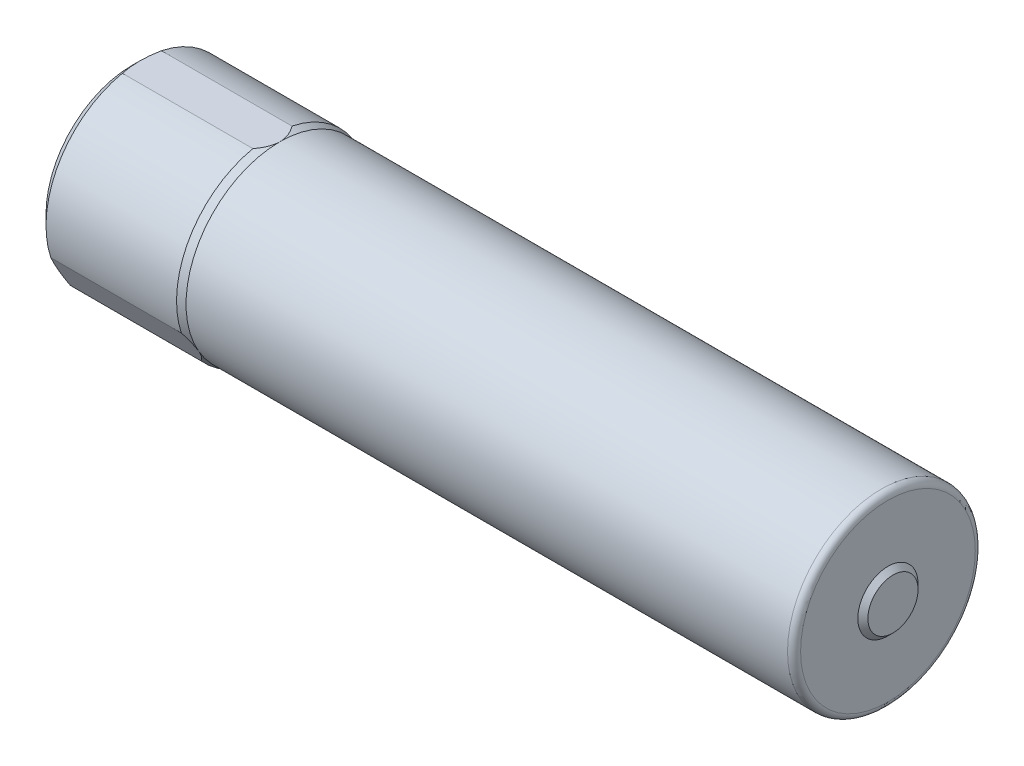
ISO-10303-21;
HEADER;
FILE_DESCRIPTION(('STEP AP214'),'2;1');
FILE_NAME('part.step','',(''),(''),'','','');
FILE_SCHEMA(('AUTOMOTIVE_DESIGN { 1 0 10303 214 1 1 1 1 }'));
ENDSEC;
DATA;
#1=APPLICATION_CONTEXT('core data for automotive mechanical design processes');
#2=APPLICATION_PROTOCOL_DEFINITION('international standard','automotive_design',2000,#1);
#3=PRODUCT_CONTEXT('',#1,'mechanical');
#4=PRODUCT('Part','Part','',(#3));
#5=PRODUCT_RELATED_PRODUCT_CATEGORY('part','',(#4));
#6=PRODUCT_DEFINITION_FORMATION('','',#4);
#7=PRODUCT_DEFINITION_CONTEXT('part definition',#1,'design');
#8=PRODUCT_DEFINITION('design','',#6,#7);
#9=PRODUCT_DEFINITION_SHAPE('','',#8);
#10=(LENGTH_UNIT() NAMED_UNIT(*) SI_UNIT(.MILLI.,.METRE.));
#11=(NAMED_UNIT(*) PLANE_ANGLE_UNIT() SI_UNIT($,.RADIAN.));
#12=(NAMED_UNIT(*) SI_UNIT($,.STERADIAN.) SOLID_ANGLE_UNIT());
#13=UNCERTAINTY_MEASURE_WITH_UNIT(LENGTH_MEASURE(1.E-05),#10,'distance_accuracy_value','');
#14=(GEOMETRIC_REPRESENTATION_CONTEXT(3) GLOBAL_UNCERTAINTY_ASSIGNED_CONTEXT((#13)) GLOBAL_UNIT_ASSIGNED_CONTEXT((#10,
#11,#12)) REPRESENTATION_CONTEXT('',''));
#15=CARTESIAN_POINT('',(0.,0.,0.));
#16=DIRECTION('',(0.,0.,1.));
#17=DIRECTION('',(1.,0.,0.));
#18=AXIS2_PLACEMENT_3D('',#15,#16,#17);
#19=CARTESIAN_POINT('',(-4.0386,-0.759778560691774,2.30363995205699));
#20=DIRECTION('',(0.,0.5,-0.866025403784436));
#21=DIRECTION('',(-1.,0.,0.));
#22=AXIS2_PLACEMENT_3D('',#19,#20,#21);
#23=PLANE('',#22);
#24=CARTESIAN_POINT('',(-19.7357999999931,-1.61512143930825,1.80980751083834));
#25=CARTESIAN_POINT('',(-19.5462118189755,-1.3990229078265,1.93457205616081));
#26=CARTESIAN_POINT('',(-19.5462118189755,-1.18744999999883,2.05672373144835));
#27=B_SPLINE_CURVE_WITH_KNOTS('',2,(#24,#25,#26),.UNSPECIFIED.,.F.,.F.,(3,3),(0.,1.),.UNSPECIFIED.);
#28=CARTESIAN_POINT('',(-19.7357999999931,-1.61512143930825,1.80980751083834));
#29=VERTEX_POINT('',#28);
#30=CARTESIAN_POINT('',(-19.5462118189755,-1.18744999999882,2.05672373144834));
#31=VERTEX_POINT('',#30);
#32=EDGE_CURVE('E378',#29,#31,#27,.T.);
#33=ORIENTED_EDGE('',*,*,#32,.T.);
#34=CARTESIAN_POINT('',(-19.5462118189755,-1.18744999999883,2.05672373144835));
#35=CARTESIAN_POINT('',(-19.5462118189755,-0.97587709217675,2.17887540673266));
#36=CARTESIAN_POINT('',(-19.7358000000057,-0.759778560691774,2.30363995205699));
#37=B_SPLINE_CURVE_WITH_KNOTS('',2,(#34,#35,#36),.UNSPECIFIED.,.F.,.F.,(3,3),(0.,1.),.UNSPECIFIED.);
#38=CARTESIAN_POINT('',(-19.7358000000057,-0.759778560691774,2.30363995205699));
#39=VERTEX_POINT('',#38);
#40=EDGE_CURVE('E302',#31,#39,#37,.T.);
#41=ORIENTED_EDGE('',*,*,#40,.T.);
#42=DIRECTION('',(-1.,0.,0.));
#43=VECTOR('',#42,1.);
#44=CARTESIAN_POINT('',(-4.0386,-0.759778560691774,2.30363995205699));
#45=LINE('',#44,#43);
#46=CARTESIAN_POINT('',(-23.0378,-0.759778560691773,2.30363995205699));
#47=VERTEX_POINT('',#46);
#48=EDGE_CURVE('E132',#39,#47,#45,.T.);
#49=ORIENTED_EDGE('',*,*,#48,.T.);
#50=CARTESIAN_POINT('',(-23.0378,-0.759778560691774,2.30363995205699));
#51=CARTESIAN_POINT('',(-23.0884059182559,-0.975051486261305,2.17935207053018));
#52=CARTESIAN_POINT('',(-23.0885996223804,-1.1862901666526,2.05739336154301));
#53=CARTESIAN_POINT('',(-23.0887939400253,-1.39819790476204,1.93504837190216));
#54=CARTESIAN_POINT('',(-23.0378,-1.61512143930825,1.80980751083834));
#55=B_SPLINE_CURVE_WITH_KNOTS('',2,(#50,#51,#52,#53,#54),.UNSPECIFIED.,.F.,.F.,(3,2,3),(0.,0.5,
1.),.UNSPECIFIED.);
#56=CARTESIAN_POINT('',(-23.0378,-1.61512143930825,1.80980751083834));
#57=VERTEX_POINT('',#56);
#58=EDGE_CURVE('E152',#47,#57,#55,.T.);
#59=ORIENTED_EDGE('',*,*,#58,.T.);
#60=DIRECTION('',(-1.,0.,0.));
#61=VECTOR('',#60,1.);
#62=CARTESIAN_POINT('',(-4.0386,-1.61512143930825,1.80980751083834));
#63=LINE('',#62,#61);
#64=EDGE_CURVE('E131',#29,#57,#63,.T.);
#65=ORIENTED_EDGE('',*,*,#64,.F.);
#66=EDGE_LOOP('',(#33,#41,#49,#59,#65));
#67=FACE_BOUND('',#66,.T.);
#68=ADVANCED_FACE('F17',(#67),#23,.F.);
#69=CARTESIAN_POINT('',(-4.0386,-1.61512143930822,-1.80980751083835));
#70=DIRECTION('',(0.,0.499999999999992,0.866025403784443));
#71=DIRECTION('',(1.,0.,0.));
#72=AXIS2_PLACEMENT_3D('',#69,#70,#71);
#73=PLANE('',#72);
#74=CARTESIAN_POINT('',(-19.7357999999931,-0.759778560691744,-2.303639952057));
#75=CARTESIAN_POINT('',(-19.5462118189755,-0.975877092173492,-2.17887540673453));
#76=CARTESIAN_POINT('',(-19.5462118189755,-1.18745000000117,-2.05672373144699));
#77=B_SPLINE_CURVE_WITH_KNOTS('',2,(#74,#75,#76),.UNSPECIFIED.,.F.,.F.,(3,3),(0.,1.),.UNSPECIFIED.);
#78=CARTESIAN_POINT('',(-19.7357999999931,-0.759778560691741,-2.303639952057));
#79=VERTEX_POINT('',#78);
#80=CARTESIAN_POINT('',(-19.5462118189755,-1.18745000000117,-2.05672373144699));
#81=VERTEX_POINT('',#80);
#82=EDGE_CURVE('E30',#79,#81,#77,.T.);
#83=ORIENTED_EDGE('',*,*,#82,.T.);
#84=CARTESIAN_POINT('',(-19.5462118189755,-1.18745000000117,-2.05672373144699));
#85=CARTESIAN_POINT('',(-19.5462118189755,-1.3990229078233,-1.93457205616265));
#86=CARTESIAN_POINT('',(-19.7358000000057,-1.61512143930822,-1.80980751083835));
#87=B_SPLINE_CURVE_WITH_KNOTS('',2,(#84,#85,#86),.UNSPECIFIED.,.F.,.F.,(3,3),(0.,1.),.UNSPECIFIED.);
#88=CARTESIAN_POINT('',(-19.7358000000057,-1.61512143930822,-1.80980751083835));
#89=VERTEX_POINT('',#88);
#90=EDGE_CURVE('E44',#81,#89,#87,.T.);
#91=ORIENTED_EDGE('',*,*,#90,.T.);
#92=DIRECTION('',(-1.,0.,0.));
#93=VECTOR('',#92,1.);
#94=CARTESIAN_POINT('',(-4.0386,-1.61512143930822,-1.80980751083835));
#95=LINE('',#94,#93);
#96=CARTESIAN_POINT('',(-23.0378,-1.61512143930822,-1.80980751083835));
#97=VERTEX_POINT('',#96);
#98=EDGE_CURVE('E379',#89,#97,#95,.T.);
#99=ORIENTED_EDGE('',*,*,#98,.T.);
#100=CARTESIAN_POINT('',(-23.0378,-1.61512143930822,-1.80980751083835));
#101=CARTESIAN_POINT('',(-23.0884059182559,-1.39984851373869,-1.93409539236516));
#102=CARTESIAN_POINT('',(-23.0885996223804,-1.1886098333474,-2.05605410135233));
#103=CARTESIAN_POINT('',(-23.0887939400253,-0.976702095237953,-2.17839909099318));
#104=CARTESIAN_POINT('',(-23.0378,-0.759778560691744,-2.303639952057));
#105=B_SPLINE_CURVE_WITH_KNOTS('',2,(#100,#101,#102,#103,#104),.UNSPECIFIED.,.F.,.F.,(3,2,3),
(0.,0.5,1.),.UNSPECIFIED.);
#106=CARTESIAN_POINT('',(-23.0378,-0.759778560691741,-2.303639952057));
#107=VERTEX_POINT('',#106);
#108=EDGE_CURVE('E209',#97,#107,#105,.T.);
#109=ORIENTED_EDGE('',*,*,#108,.T.);
#110=DIRECTION('',(-1.,0.,0.));
#111=VECTOR('',#110,1.);
#112=CARTESIAN_POINT('',(-4.0386,-0.759778560691741,-2.303639952057));
#113=LINE('',#112,#111);
#114=EDGE_CURVE('E326',#79,#107,#113,.T.);
#115=ORIENTED_EDGE('',*,*,#114,.F.);
#116=EDGE_LOOP('',(#83,#91,#99,#109,#115));
#117=FACE_BOUND('',#116,.T.);
#118=ADVANCED_FACE('F249',(#117),#73,.F.);
#119=CARTESIAN_POINT('',(-4.0386,2.3749,-0.493832441218652));
#120=DIRECTION('',(0.,-1.,0.));
#121=DIRECTION('',(0.,0.,-1.));
#122=AXIS2_PLACEMENT_3D('',#119,#120,#121);
#123=PLANE('',#122);
#124=CARTESIAN_POINT('',(-19.7358,2.3749,0.493832441218653));
#125=CARTESIAN_POINT('',(-19.5462118189755,2.3749,0.244303350550023));
#126=CARTESIAN_POINT('',(-19.5462118189755,2.3749,0.));
#127=B_SPLINE_CURVE_WITH_KNOTS('',2,(#124,#125,#126),.UNSPECIFIED.,.F.,.F.,(3,3),(0.,1.),.UNSPECIFIED.);
#128=CARTESIAN_POINT('',(-19.7358,2.3749,0.493832441218653));
#129=VERTEX_POINT('',#128);
#130=CARTESIAN_POINT('',(-19.5462118189755,2.3749,0.));
#131=VERTEX_POINT('',#130);
#132=EDGE_CURVE('E270',#129,#131,#127,.T.);
#133=ORIENTED_EDGE('',*,*,#132,.T.);
#134=CARTESIAN_POINT('',(-19.5462118189755,2.3749,0.));
#135=CARTESIAN_POINT('',(-19.5462118189755,2.3749,-0.24430335055002));
#136=CARTESIAN_POINT('',(-19.7358,2.3749,-0.493832441218652));
#137=B_SPLINE_CURVE_WITH_KNOTS('',2,(#134,#135,#136),.UNSPECIFIED.,.F.,.F.,(3,3),(0.,1.),.UNSPECIFIED.);
#138=CARTESIAN_POINT('',(-19.7358,2.3749,-0.493832441218652));
#139=VERTEX_POINT('',#138);
#140=EDGE_CURVE('E11',#131,#139,#137,.T.);
#141=ORIENTED_EDGE('',*,*,#140,.T.);
#142=DIRECTION('',(-1.,0.,0.));
#143=VECTOR('',#142,1.);
#144=CARTESIAN_POINT('',(-4.0386,2.3749,-0.493832441218652));
#145=LINE('',#144,#143);
#146=CARTESIAN_POINT('',(-23.0378,2.3749,-0.493832441218652));
#147=VERTEX_POINT('',#146);
#148=EDGE_CURVE('E139',#139,#147,#145,.T.);
#149=ORIENTED_EDGE('',*,*,#148,.T.);
#150=CARTESIAN_POINT('',(-23.0378,2.3749,-0.493832441218652));
#151=CARTESIAN_POINT('',(-23.0885171507433,2.3749,-0.244710305268566));
#152=CARTESIAN_POINT('',(-23.0885999866292,2.3749,-0.000252008570146068));
#153=CARTESIAN_POINT('',(-23.0886827177257,2.3749,0.243897041910937));
#154=CARTESIAN_POINT('',(-23.0378,2.3749,0.493832441218653));
#155=B_SPLINE_CURVE_WITH_KNOTS('',2,(#150,#151,#152,#153,#154),.UNSPECIFIED.,.F.,.F.,(3,2,3),
(0.,0.5,1.),.UNSPECIFIED.);
#156=CARTESIAN_POINT('',(-23.0378,2.3749,0.493832441218653));
#157=VERTEX_POINT('',#156);
#158=EDGE_CURVE('E135',#147,#157,#155,.T.);
#159=ORIENTED_EDGE('',*,*,#158,.T.);
#160=DIRECTION('',(-1.,0.,0.));
#161=VECTOR('',#160,1.);
#162=CARTESIAN_POINT('',(-4.0386,2.3749,0.493832441218653));
#163=LINE('',#162,#161);
#164=EDGE_CURVE('E119',#129,#157,#163,.T.);
#165=ORIENTED_EDGE('',*,*,#164,.F.);
#166=EDGE_LOOP('',(#133,#141,#149,#159,#165));
#167=FACE_BOUND('',#166,.T.);
#168=ADVANCED_FACE('F137',(#167),#123,.F.);
#169=CARTESIAN_POINT('',(-23.2918,0.,0.));
#170=DIRECTION('',(1.,0.,0.));
#171=DIRECTION('',(0.,1.,0.));
#172=AXIS2_PLACEMENT_3D('',#169,#170,#171);
#173=PLANE('',#172);
#174=CARTESIAN_POINT('',(-23.2918,0.,0.));
#175=DIRECTION('',(-1.,0.,0.));
#176=DIRECTION('',(0.,0.,-1.));
#177=AXIS2_PLACEMENT_3D('',#174,#175,#176);
#178=CIRCLE('',#177,2.1717);
#179=CARTESIAN_POINT('',(-23.2918,0.,-2.1717));
#180=VERTEX_POINT('',#179);
#181=EDGE_CURVE('E210',#180,#180,#178,.T.);
#182=ORIENTED_EDGE('',*,*,#181,.T.);
#183=EDGE_LOOP('',(#182));
#184=FACE_BOUND('',#183,.T.);
#185=ADVANCED_FACE('F248',(#184),#173,.F.);
#186=CARTESIAN_POINT('',(-4.0386,0.,0.));
#187=DIRECTION('',(1.,0.,0.));
#188=DIRECTION('',(0.,1.,0.));
#189=AXIS2_PLACEMENT_3D('',#186,#187,#188);
#190=PLANE('',#189);
#191=CARTESIAN_POINT('',(-4.0386,0.,0.));
#192=DIRECTION('',(1.,0.,0.));
#193=DIRECTION('',(0.,0.,-1.));
#194=AXIS2_PLACEMENT_3D('',#191,#192,#193);
#195=CIRCLE('',#194,0.635);
#196=CARTESIAN_POINT('',(-4.0386,0.,0.635));
#197=VERTEX_POINT('',#196);
#198=EDGE_CURVE('E230',#197,#197,#195,.T.);
#199=ORIENTED_EDGE('',*,*,#198,.T.);
#200=EDGE_LOOP('',(#199));
#201=FACE_BOUND('',#200,.T.);
#202=ADVANCED_FACE('F473',(#201),#190,.T.);
#203=CARTESIAN_POINT('',(-4.1656,2.3749,0.));
#204=DIRECTION('',(-1.,0.,0.));
#205=DIRECTION('',(0.,0.,1.));
#206=AXIS2_PLACEMENT_3D('',#203,#204,#205);
#207=PLANE('',#206);
#208=CARTESIAN_POINT('',(-4.1656,0.,0.));
#209=DIRECTION('',(1.,0.,0.));
#210=DIRECTION('',(0.,0.,-1.));
#211=AXIS2_PLACEMENT_3D('',#208,#209,#210);
#212=CIRCLE('',#211,0.762);
#213=CARTESIAN_POINT('',(-4.1656,0.,0.762));
#214=VERTEX_POINT('',#213);
#215=EDGE_CURVE('E422',#214,#214,#212,.T.);
#216=ORIENTED_EDGE('',*,*,#215,.F.);
#217=EDGE_LOOP('',(#216));
#218=FACE_BOUND('',#217,.T.);
#219=CARTESIAN_POINT('',(-4.1656,0.,0.));
#220=DIRECTION('',(1.,0.,0.));
#221=DIRECTION('',(0.,0.,1.));
#222=AXIS2_PLACEMENT_3D('',#219,#220,#221);
#223=CIRCLE('',#222,2.2098);
#224=CARTESIAN_POINT('',(-4.1656,0.,2.2098));
#225=VERTEX_POINT('',#224);
#226=EDGE_CURVE('E226',#225,#225,#223,.T.);
#227=ORIENTED_EDGE('',*,*,#226,.T.);
#228=EDGE_LOOP('',(#227));
#229=FACE_BOUND('',#228,.T.);
#230=ADVANCED_FACE('F250',(#218,#229),#207,.F.);
#231=CARTESIAN_POINT('',(-19.5462118189755,0.,0.));
#232=DIRECTION('',(-1.,0.,0.));
#233=DIRECTION('',(0.,0.,1.));
#234=AXIS2_PLACEMENT_3D('',#231,#232,#233);
#235=CONICAL_SURFACE('',#234,2.3749,0.261799387799148);
#236=ORIENTED_EDGE('',*,*,#82,.F.);
#237=CARTESIAN_POINT('',(-19.7358,0.,0.));
#238=DIRECTION('',(1.,0.,0.));
#239=DIRECTION('',(0.,0.,-1.));
#240=AXIS2_PLACEMENT_3D('',#237,#238,#239);
#241=CIRCLE('',#240,2.4257);
#242=EDGE_CURVE('E324',#79,#139,#241,.T.);
#243=ORIENTED_EDGE('',*,*,#242,.T.);
#244=ORIENTED_EDGE('',*,*,#140,.F.);
#245=CARTESIAN_POINT('',(-19.5462118189755,0.,0.));
#246=DIRECTION('',(-1.,0.,0.));
#247=DIRECTION('',(0.,0.,1.));
#248=AXIS2_PLACEMENT_3D('',#245,#246,#247);
#249=CIRCLE('',#248,2.3749);
#250=EDGE_CURVE('E419',#131,#81,#249,.T.);
#251=ORIENTED_EDGE('',*,*,#250,.T.);
#252=EDGE_LOOP('',(#236,#243,#244,#251));
#253=FACE_BOUND('',#252,.T.);
#254=ADVANCED_FACE('F283',(#253),#235,.T.);
#255=CARTESIAN_POINT('',(-19.5462118189755,0.,0.));
#256=DIRECTION('',(-1.,0.,0.));
#257=DIRECTION('',(0.,0.,1.));
#258=AXIS2_PLACEMENT_3D('',#255,#256,#257);
#259=CONICAL_SURFACE('',#258,2.3749,0.261799387799148);
#260=ORIENTED_EDGE('',*,*,#32,.F.);
#261=CARTESIAN_POINT('',(-19.7358,0.,0.));
#262=DIRECTION('',(1.,0.,0.));
#263=DIRECTION('',(0.,0.,-1.));
#264=AXIS2_PLACEMENT_3D('',#261,#262,#263);
#265=CIRCLE('',#264,2.4257);
#266=EDGE_CURVE('E370',#29,#89,#265,.T.);
#267=ORIENTED_EDGE('',*,*,#266,.T.);
#268=ORIENTED_EDGE('',*,*,#90,.F.);
#269=CARTESIAN_POINT('',(-19.5462118189755,0.,0.));
#270=DIRECTION('',(-1.,0.,0.));
#271=DIRECTION('',(0.,0.,1.));
#272=AXIS2_PLACEMENT_3D('',#269,#270,#271);
#273=CIRCLE('',#272,2.3749);
#274=EDGE_CURVE('E299',#81,#31,#273,.T.);
#275=ORIENTED_EDGE('',*,*,#274,.T.);
#276=EDGE_LOOP('',(#260,#267,#268,#275));
#277=FACE_BOUND('',#276,.T.);
#278=ADVANCED_FACE('F348',(#277),#259,.T.);
#279=CARTESIAN_POINT('',(-3.21287265761912,0.,0.));
#280=DIRECTION('',(1.,0.,0.));
#281=DIRECTION('',(0.,0.,-1.));
#282=AXIS2_PLACEMENT_3D('',#279,#280,#281);
#283=CYLINDRICAL_SURFACE('',#282,2.4257);
#284=ORIENTED_EDGE('',*,*,#64,.T.);
#285=CARTESIAN_POINT('',(-23.0378,0.,0.));
#286=DIRECTION('',(1.,0.,0.));
#287=DIRECTION('',(0.,0.,-1.));
#288=AXIS2_PLACEMENT_3D('',#285,#286,#287);
#289=CIRCLE('',#288,2.4257);
#290=EDGE_CURVE('E161',#57,#97,#289,.T.);
#291=ORIENTED_EDGE('',*,*,#290,.T.);
#292=ORIENTED_EDGE('',*,*,#98,.F.);
#293=ORIENTED_EDGE('',*,*,#266,.F.);
#294=EDGE_LOOP('',(#284,#291,#292,#293));
#295=FACE_BOUND('',#294,.T.);
#296=ADVANCED_FACE('F194',(#295),#283,.T.);
#297=CARTESIAN_POINT('',(-3.21287265761912,0.,0.));
#298=DIRECTION('',(1.,0.,0.));
#299=DIRECTION('',(0.,0.,-1.));
#300=AXIS2_PLACEMENT_3D('',#297,#298,#299);
#301=CYLINDRICAL_SURFACE('',#300,2.4257);
#302=ORIENTED_EDGE('',*,*,#48,.F.);
#303=CARTESIAN_POINT('',(-19.7358,0.,0.));
#304=DIRECTION('',(1.,0.,0.));
#305=DIRECTION('',(0.,0.,-1.));
#306=AXIS2_PLACEMENT_3D('',#303,#304,#305);
#307=CIRCLE('',#306,2.4257);
#308=EDGE_CURVE('E126',#129,#39,#307,.T.);
#309=ORIENTED_EDGE('',*,*,#308,.F.);
#310=ORIENTED_EDGE('',*,*,#164,.T.);
#311=CARTESIAN_POINT('',(-23.0378,0.,0.));
#312=DIRECTION('',(1.,0.,0.));
#313=DIRECTION('',(0.,0.,-1.));
#314=AXIS2_PLACEMENT_3D('',#311,#312,#313);
#315=CIRCLE('',#314,2.4257);
#316=EDGE_CURVE('E123',#157,#47,#315,.T.);
#317=ORIENTED_EDGE('',*,*,#316,.T.);
#318=EDGE_LOOP('',(#302,#309,#310,#317));
#319=FACE_BOUND('',#318,.T.);
#320=ADVANCED_FACE('F121',(#319),#301,.T.);
#321=CARTESIAN_POINT('',(-23.2918,0.,0.));
#322=DIRECTION('',(1.,0.,0.));
#323=DIRECTION('',(0.,0.,-1.));
#324=AXIS2_PLACEMENT_3D('',#321,#322,#323);
#325=CYLINDRICAL_SURFACE('',#324,2.3749);
#326=CARTESIAN_POINT('',(-4.3307,0.,0.));
#327=DIRECTION('',(-1.,0.,0.));
#328=DIRECTION('',(0.,0.,1.));
#329=AXIS2_PLACEMENT_3D('',#326,#327,#328);
#330=CIRCLE('',#329,2.3749);
#331=CARTESIAN_POINT('',(-4.3307,0.,2.3749));
#332=VERTEX_POINT('',#331);
#333=EDGE_CURVE('E219',#332,#332,#330,.T.);
#334=ORIENTED_EDGE('',*,*,#333,.T.);
#335=EDGE_LOOP('',(#334));
#336=FACE_BOUND('',#335,.T.);
#337=ORIENTED_EDGE('',*,*,#250,.F.);
#338=CARTESIAN_POINT('',(-19.5462118189755,0.,0.));
#339=DIRECTION('',(-1.,0.,0.));
#340=DIRECTION('',(0.,0.,1.));
#341=AXIS2_PLACEMENT_3D('',#338,#339,#340);
#342=CIRCLE('',#341,2.3749);
#343=EDGE_CURVE('E145',#31,#131,#342,.T.);
#344=ORIENTED_EDGE('',*,*,#343,.F.);
#345=ORIENTED_EDGE('',*,*,#274,.F.);
#346=EDGE_LOOP('',(#337,#344,#345));
#347=FACE_BOUND('',#346,.T.);
#348=ADVANCED_FACE('F417',(#336,#347),#325,.T.);
#349=CARTESIAN_POINT('',(-4.1656,0.,0.));
#350=DIRECTION('',(-1.,0.,0.));
#351=DIRECTION('',(0.,0.,1.));
#352=AXIS2_PLACEMENT_3D('',#349,#350,#351);
#353=CONICAL_SURFACE('',#352,0.762,0.785398163397453);
#354=ORIENTED_EDGE('',*,*,#215,.T.);
#355=EDGE_LOOP('',(#354));
#356=FACE_BOUND('',#355,.T.);
#357=ORIENTED_EDGE('',*,*,#198,.F.);
#358=EDGE_LOOP('',(#357));
#359=FACE_BOUND('',#358,.T.);
#360=ADVANCED_FACE('F252',(#356,#359),#353,.T.);
#361=CARTESIAN_POINT('',(-3.21287265761912,0.,0.));
#362=DIRECTION('',(1.,0.,0.));
#363=DIRECTION('',(0.,0.,-1.));
#364=AXIS2_PLACEMENT_3D('',#361,#362,#363);
#365=CYLINDRICAL_SURFACE('',#364,2.4257);
#366=CARTESIAN_POINT('',(-23.0378,0.,0.));
#367=DIRECTION('',(1.,0.,0.));
#368=DIRECTION('',(0.,0.,-1.));
#369=AXIS2_PLACEMENT_3D('',#366,#367,#368);
#370=CIRCLE('',#369,2.4257);
#371=EDGE_CURVE('E202',#107,#147,#370,.T.);
#372=ORIENTED_EDGE('',*,*,#371,.T.);
#373=ORIENTED_EDGE('',*,*,#148,.F.);
#374=ORIENTED_EDGE('',*,*,#242,.F.);
#375=ORIENTED_EDGE('',*,*,#114,.T.);
#376=EDGE_LOOP('',(#372,#373,#374,#375));
#377=FACE_BOUND('',#376,.T.);
#378=ADVANCED_FACE('F282',(#377),#365,.T.);
#379=CARTESIAN_POINT('',(-19.5462118189755,0.,0.));
#380=DIRECTION('',(-1.,0.,0.));
#381=DIRECTION('',(0.,0.,1.));
#382=AXIS2_PLACEMENT_3D('',#379,#380,#381);
#383=CONICAL_SURFACE('',#382,2.3749,0.261799387799148);
#384=ORIENTED_EDGE('',*,*,#343,.T.);
#385=ORIENTED_EDGE('',*,*,#132,.F.);
#386=ORIENTED_EDGE('',*,*,#308,.T.);
#387=ORIENTED_EDGE('',*,*,#40,.F.);
#388=EDGE_LOOP('',(#384,#385,#386,#387));
#389=FACE_BOUND('',#388,.T.);
#390=ADVANCED_FACE('F193',(#389),#383,.T.);
#391=CARTESIAN_POINT('',(-23.0378,0.,0.));
#392=DIRECTION('',(1.,0.,0.));
#393=DIRECTION('',(0.,0.,-1.));
#394=AXIS2_PLACEMENT_3D('',#391,#392,#393);
#395=CONICAL_SURFACE('',#394,2.4257,0.785398163397441);
#396=ORIENTED_EDGE('',*,*,#371,.F.);
#397=ORIENTED_EDGE('',*,*,#108,.F.);
#398=ORIENTED_EDGE('',*,*,#290,.F.);
#399=ORIENTED_EDGE('',*,*,#58,.F.);
#400=ORIENTED_EDGE('',*,*,#316,.F.);
#401=ORIENTED_EDGE('',*,*,#158,.F.);
#402=EDGE_LOOP('',(#396,#397,#398,#399,#400,#401));
#403=FACE_BOUND('',#402,.T.);
#404=ORIENTED_EDGE('',*,*,#181,.F.);
#405=EDGE_LOOP('',(#404));
#406=FACE_BOUND('',#405,.T.);
#407=ADVANCED_FACE('F148',(#403,#406),#395,.T.);
#408=CARTESIAN_POINT('',(-4.3307,0.,0.));
#409=DIRECTION('',(-1.,0.,0.));
#410=DIRECTION('',(0.,0.,1.));
#411=AXIS2_PLACEMENT_3D('',#408,#409,#410);
#412=TOROIDAL_SURFACE('',#411,2.2098,0.1651);
#413=ORIENTED_EDGE('',*,*,#333,.F.);
#414=EDGE_LOOP('',(#413));
#415=FACE_BOUND('',#414,.T.);
#416=ORIENTED_EDGE('',*,*,#226,.F.);
#417=EDGE_LOOP('',(#416));
#418=FACE_BOUND('',#417,.T.);
#419=ADVANCED_FACE('F192',(#415,#418),#412,.T.);
#420=CLOSED_SHELL('',(#68,#118,#168,#185,#202,#230,#254,#278,#296,#320,#348,#360,#378,#390,#407,#419));
#421=MANIFOLD_SOLID_BREP('B1',#420);
#422=ADVANCED_BREP_SHAPE_REPRESENTATION('',(#18,#421),#14);
#423=SHAPE_DEFINITION_REPRESENTATION(#9,#422);
ENDSEC;
END-ISO-10303-21;
